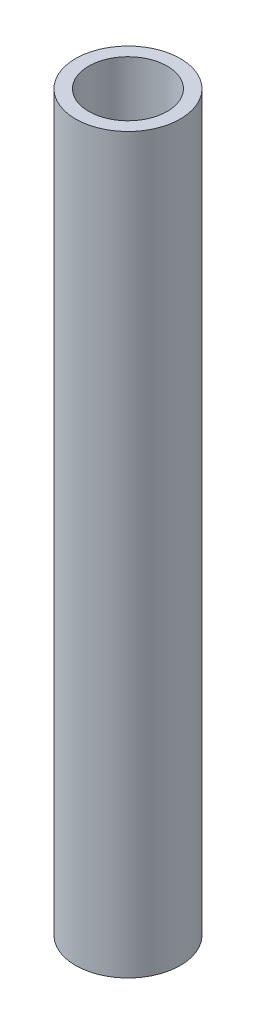
ISO-10303-21;
HEADER;
FILE_DESCRIPTION(('STEP AP214'),'2;1');
FILE_NAME('part.step','',(''),(''),'','','');
FILE_SCHEMA(('AUTOMOTIVE_DESIGN { 1 0 10303 214 1 1 1 1 }'));
ENDSEC;
DATA;
#1=APPLICATION_CONTEXT('core data for automotive mechanical design processes');
#2=APPLICATION_PROTOCOL_DEFINITION('international standard','automotive_design',2000,#1);
#3=PRODUCT_CONTEXT('',#1,'mechanical');
#4=PRODUCT('Part','Part','',(#3));
#5=PRODUCT_RELATED_PRODUCT_CATEGORY('part','',(#4));
#6=PRODUCT_DEFINITION_FORMATION('','',#4);
#7=PRODUCT_DEFINITION_CONTEXT('part definition',#1,'design');
#8=PRODUCT_DEFINITION('design','',#6,#7);
#9=PRODUCT_DEFINITION_SHAPE('','',#8);
#10=(LENGTH_UNIT() NAMED_UNIT(*) SI_UNIT(.MILLI.,.METRE.));
#11=(NAMED_UNIT(*) PLANE_ANGLE_UNIT() SI_UNIT($,.RADIAN.));
#12=(NAMED_UNIT(*) SI_UNIT($,.STERADIAN.) SOLID_ANGLE_UNIT());
#13=UNCERTAINTY_MEASURE_WITH_UNIT(LENGTH_MEASURE(1.E-05),#10,'distance_accuracy_value','');
#14=(GEOMETRIC_REPRESENTATION_CONTEXT(3) GLOBAL_UNCERTAINTY_ASSIGNED_CONTEXT((#13)) GLOBAL_UNIT_ASSIGNED_CONTEXT((#10,
#11,#12)) REPRESENTATION_CONTEXT('',''));
#15=CARTESIAN_POINT('',(0.,0.,0.));
#16=DIRECTION('',(0.,0.,1.));
#17=DIRECTION('',(1.,0.,0.));
#18=AXIS2_PLACEMENT_3D('',#15,#16,#17);
#19=CARTESIAN_POINT('',(0.,177.8,0.));
#20=DIRECTION('',(0.,1.,0.));
#21=DIRECTION('',(0.,0.,1.));
#22=AXIS2_PLACEMENT_3D('',#19,#20,#21);
#23=PLANE('',#22);
#24=CARTESIAN_POINT('',(0.,177.8,0.));
#25=DIRECTION('',(0.,1.,0.));
#26=DIRECTION('',(0.,0.,1.));
#27=AXIS2_PLACEMENT_3D('',#24,#25,#26);
#28=CIRCLE('',#27,12.7);
#29=CARTESIAN_POINT('',(0.,177.8,12.7));
#30=VERTEX_POINT('',#29);
#31=EDGE_CURVE('E10',#30,#30,#28,.T.);
#32=ORIENTED_EDGE('',*,*,#31,.T.);
#33=EDGE_LOOP('',(#32));
#34=FACE_BOUND('',#33,.T.);
#35=CARTESIAN_POINT('',(0.,177.8,0.));
#36=DIRECTION('',(0.,1.,0.));
#37=DIRECTION('',(0.,0.,1.));
#38=AXIS2_PLACEMENT_3D('',#35,#36,#37);
#39=CIRCLE('',#38,9.52500000000002);
#40=CARTESIAN_POINT('',(0.,177.8,9.52500000000002));
#41=VERTEX_POINT('',#40);
#42=EDGE_CURVE('E42',#41,#41,#39,.T.);
#43=ORIENTED_EDGE('',*,*,#42,.F.);
#44=EDGE_LOOP('',(#43));
#45=FACE_BOUND('',#44,.T.);
#46=ADVANCED_FACE('F31',(#34,#45),#23,.T.);
#47=CARTESIAN_POINT('',(0.,0.,0.));
#48=DIRECTION('',(0.,1.,0.));
#49=DIRECTION('',(0.,0.,1.));
#50=AXIS2_PLACEMENT_3D('',#47,#48,#49);
#51=PLANE('',#50);
#52=CARTESIAN_POINT('',(0.,0.,0.));
#53=DIRECTION('',(0.,1.,0.));
#54=DIRECTION('',(0.,0.,1.));
#55=AXIS2_PLACEMENT_3D('',#52,#53,#54);
#56=CIRCLE('',#55,12.7);
#57=CARTESIAN_POINT('',(0.,0.,12.7));
#58=VERTEX_POINT('',#57);
#59=EDGE_CURVE('E35',#58,#58,#56,.T.);
#60=ORIENTED_EDGE('',*,*,#59,.F.);
#61=EDGE_LOOP('',(#60));
#62=FACE_BOUND('',#61,.T.);
#63=CARTESIAN_POINT('',(0.,0.,0.));
#64=DIRECTION('',(0.,1.,0.));
#65=DIRECTION('',(0.,0.,1.));
#66=AXIS2_PLACEMENT_3D('',#63,#64,#65);
#67=CIRCLE('',#66,9.52500000000002);
#68=CARTESIAN_POINT('',(0.,0.,9.52500000000002));
#69=VERTEX_POINT('',#68);
#70=EDGE_CURVE('E44',#69,#69,#67,.T.);
#71=ORIENTED_EDGE('',*,*,#70,.T.);
#72=EDGE_LOOP('',(#71));
#73=FACE_BOUND('',#72,.T.);
#74=ADVANCED_FACE('F54',(#62,#73),#51,.F.);
#75=CARTESIAN_POINT('',(0.,177.8,0.));
#76=DIRECTION('',(0.,-1.,0.));
#77=DIRECTION('',(0.,0.,-1.));
#78=AXIS2_PLACEMENT_3D('',#75,#76,#77);
#79=CYLINDRICAL_SURFACE('',#78,12.7);
#80=ORIENTED_EDGE('',*,*,#31,.F.);
#81=EDGE_LOOP('',(#80));
#82=FACE_BOUND('',#81,.T.);
#83=ORIENTED_EDGE('',*,*,#59,.T.);
#84=EDGE_LOOP('',(#83));
#85=FACE_BOUND('',#84,.T.);
#86=ADVANCED_FACE('F33',(#82,#85),#79,.T.);
#87=CARTESIAN_POINT('',(0.,177.8,0.));
#88=DIRECTION('',(0.,-1.,0.));
#89=DIRECTION('',(0.,0.,-1.));
#90=AXIS2_PLACEMENT_3D('',#87,#88,#89);
#91=CYLINDRICAL_SURFACE('',#90,9.52500000000002);
#92=ORIENTED_EDGE('',*,*,#42,.T.);
#93=EDGE_LOOP('',(#92));
#94=FACE_BOUND('',#93,.T.);
#95=ORIENTED_EDGE('',*,*,#70,.F.);
#96=EDGE_LOOP('',(#95));
#97=FACE_BOUND('',#96,.T.);
#98=ADVANCED_FACE('F50',(#94,#97),#91,.F.);
#99=CLOSED_SHELL('',(#46,#74,#86,#98));
#100=MANIFOLD_SOLID_BREP('B2',#99);
#101=ADVANCED_BREP_SHAPE_REPRESENTATION('',(#18,#100),#14);
#102=SHAPE_DEFINITION_REPRESENTATION(#9,#101);
ENDSEC;
END-ISO-10303-21;
